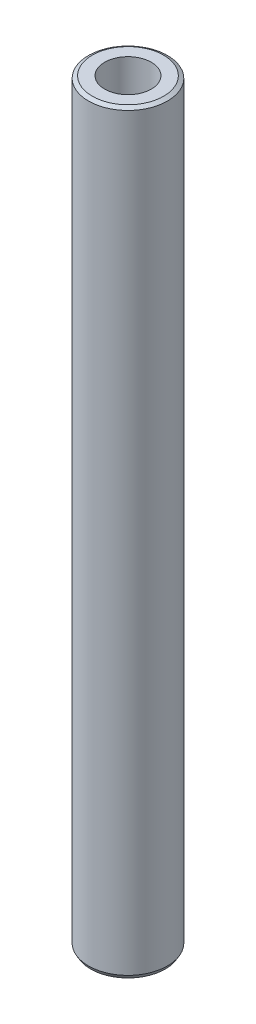
ISO-10303-21;
HEADER;
FILE_DESCRIPTION(('STEP AP214'),'2;1');
FILE_NAME('part.step','',(''),(''),'','','');
FILE_SCHEMA(('AUTOMOTIVE_DESIGN { 1 0 10303 214 1 1 1 1 }'));
ENDSEC;
DATA;
#1=APPLICATION_CONTEXT('core data for automotive mechanical design processes');
#2=APPLICATION_PROTOCOL_DEFINITION('international standard','automotive_design',2000,#1);
#3=PRODUCT_CONTEXT('',#1,'mechanical');
#4=PRODUCT('Part','Part','',(#3));
#5=PRODUCT_RELATED_PRODUCT_CATEGORY('part','',(#4));
#6=PRODUCT_DEFINITION_FORMATION('','',#4);
#7=PRODUCT_DEFINITION_CONTEXT('part definition',#1,'design');
#8=PRODUCT_DEFINITION('design','',#6,#7);
#9=PRODUCT_DEFINITION_SHAPE('','',#8);
#10=(LENGTH_UNIT() NAMED_UNIT(*) SI_UNIT(.MILLI.,.METRE.));
#11=(NAMED_UNIT(*) PLANE_ANGLE_UNIT() SI_UNIT($,.RADIAN.));
#12=(NAMED_UNIT(*) SI_UNIT($,.STERADIAN.) SOLID_ANGLE_UNIT());
#13=UNCERTAINTY_MEASURE_WITH_UNIT(LENGTH_MEASURE(1.E-05),#10,'distance_accuracy_value','');
#14=(GEOMETRIC_REPRESENTATION_CONTEXT(3) GLOBAL_UNCERTAINTY_ASSIGNED_CONTEXT((#13)) GLOBAL_UNIT_ASSIGNED_CONTEXT((#10,
#11,#12)) REPRESENTATION_CONTEXT('',''));
#15=CARTESIAN_POINT('',(0.,0.,0.));
#16=DIRECTION('',(0.,0.,1.));
#17=DIRECTION('',(1.,0.,0.));
#18=AXIS2_PLACEMENT_3D('',#15,#16,#17);
#19=CARTESIAN_POINT('',(0.,191.178711764376,0.));
#20=DIRECTION('',(0.,-1.,0.));
#21=DIRECTION('',(0.,0.,-1.));
#22=AXIS2_PLACEMENT_3D('',#19,#20,#21);
#23=CYLINDRICAL_SURFACE('',#22,10.);
#24=CARTESIAN_POINT('',(0.,190.615462888149,0.));
#25=DIRECTION('',(0.,1.,0.));
#26=DIRECTION('',(0.,0.,1.));
#27=AXIS2_PLACEMENT_3D('',#24,#25,#26);
#28=CIRCLE('',#27,10.);
#29=CARTESIAN_POINT('',(0.,190.615462888149,10.));
#30=VERTEX_POINT('',#29);
#31=EDGE_CURVE('E50',#30,#30,#28,.F.);
#32=ORIENTED_EDGE('',*,*,#31,.T.);
#33=EDGE_LOOP('',(#32));
#34=FACE_BOUND('',#33,.T.);
#35=CARTESIAN_POINT('',(0.,0.975575670930651,0.));
#36=DIRECTION('',(0.,1.,0.));
#37=DIRECTION('',(0.,0.,1.));
#38=AXIS2_PLACEMENT_3D('',#35,#36,#37);
#39=CIRCLE('',#38,10.);
#40=CARTESIAN_POINT('',(0.,0.975575670930651,10.));
#41=VERTEX_POINT('',#40);
#42=EDGE_CURVE('E51',#41,#41,#39,.T.);
#43=ORIENTED_EDGE('',*,*,#42,.T.);
#44=EDGE_LOOP('',(#43));
#45=FACE_BOUND('',#44,.T.);
#46=ADVANCED_FACE('F39',(#34,#45),#23,.T.);
#47=CARTESIAN_POINT('',(0.,191.178711764376,0.));
#48=DIRECTION('',(0.,1.,0.));
#49=DIRECTION('',(0.,0.,1.));
#50=AXIS2_PLACEMENT_3D('',#47,#48,#49);
#51=PLANE('',#50);
#52=CARTESIAN_POINT('',(0.,191.178711764376,0.));
#53=DIRECTION('',(0.,1.,0.));
#54=DIRECTION('',(0.,0.,1.));
#55=AXIS2_PLACEMENT_3D('',#52,#53,#54);
#56=CIRCLE('',#55,9.02442432906936);
#57=CARTESIAN_POINT('',(0.,191.178711764376,9.02442432906936));
#58=VERTEX_POINT('',#57);
#59=EDGE_CURVE('E54',#58,#58,#56,.T.);
#60=ORIENTED_EDGE('',*,*,#59,.T.);
#61=EDGE_LOOP('',(#60));
#62=FACE_BOUND('',#61,.T.);
#63=CARTESIAN_POINT('',(0.,191.178711764376,0.));
#64=DIRECTION('',(0.,1.,0.));
#65=DIRECTION('',(0.,0.,1.));
#66=AXIS2_PLACEMENT_3D('',#63,#64,#65);
#67=CIRCLE('',#66,5.90377454424036);
#68=CARTESIAN_POINT('',(0.,191.178711764376,5.90377454424036));
#69=VERTEX_POINT('',#68);
#70=EDGE_CURVE('E58',#69,#69,#67,.T.);
#71=ORIENTED_EDGE('',*,*,#70,.F.);
#72=EDGE_LOOP('',(#71));
#73=FACE_BOUND('',#72,.T.);
#74=ADVANCED_FACE('F69',(#62,#73),#51,.T.);
#75=CARTESIAN_POINT('',(0.,0.,0.));
#76=DIRECTION('',(0.,1.,0.));
#77=DIRECTION('',(0.,0.,1.));
#78=AXIS2_PLACEMENT_3D('',#75,#76,#77);
#79=PLANE('',#78);
#80=CARTESIAN_POINT('',(0.,0.,0.));
#81=DIRECTION('',(0.,1.,0.));
#82=DIRECTION('',(0.,0.,1.));
#83=AXIS2_PLACEMENT_3D('',#80,#81,#82);
#84=CIRCLE('',#83,9.43675112377333);
#85=CARTESIAN_POINT('',(0.,0.,9.43675112377333));
#86=VERTEX_POINT('',#85);
#87=EDGE_CURVE('E10',#86,#86,#84,.F.);
#88=ORIENTED_EDGE('',*,*,#87,.T.);
#89=EDGE_LOOP('',(#88));
#90=FACE_BOUND('',#89,.T.);
#91=CARTESIAN_POINT('',(0.,0.,0.));
#92=DIRECTION('',(0.,1.,0.));
#93=DIRECTION('',(0.,0.,1.));
#94=AXIS2_PLACEMENT_3D('',#91,#92,#93);
#95=CIRCLE('',#94,5.90377454424036);
#96=CARTESIAN_POINT('',(0.,0.,5.90377454424036));
#97=VERTEX_POINT('',#96);
#98=EDGE_CURVE('E63',#97,#97,#95,.T.);
#99=ORIENTED_EDGE('',*,*,#98,.T.);
#100=EDGE_LOOP('',(#99));
#101=FACE_BOUND('',#100,.T.);
#102=ADVANCED_FACE('F75',(#90,#101),#79,.F.);
#103=CARTESIAN_POINT('',(0.,191.178711764376,0.));
#104=DIRECTION('',(0.,-1.,0.));
#105=DIRECTION('',(0.,0.,-1.));
#106=AXIS2_PLACEMENT_3D('',#103,#104,#105);
#107=CYLINDRICAL_SURFACE('',#106,5.90377454424036);
#108=ORIENTED_EDGE('',*,*,#70,.T.);
#109=EDGE_LOOP('',(#108));
#110=FACE_BOUND('',#109,.T.);
#111=ORIENTED_EDGE('',*,*,#98,.F.);
#112=EDGE_LOOP('',(#111));
#113=FACE_BOUND('',#112,.T.);
#114=ADVANCED_FACE('F70',(#110,#113),#107,.F.);
#115=CARTESIAN_POINT('',(0.,191.178711764376,0.));
#116=DIRECTION('',(0.,-1.,0.));
#117=DIRECTION('',(0.,0.,-1.));
#118=AXIS2_PLACEMENT_3D('',#115,#116,#117);
#119=CONICAL_SURFACE('',#118,9.02442432906936,1.04719755119659);
#120=ORIENTED_EDGE('',*,*,#31,.F.);
#121=EDGE_LOOP('',(#120));
#122=FACE_BOUND('',#121,.T.);
#123=ORIENTED_EDGE('',*,*,#59,.F.);
#124=EDGE_LOOP('',(#123));
#125=FACE_BOUND('',#124,.T.);
#126=ADVANCED_FACE('F81',(#122,#125),#119,.T.);
#127=CARTESIAN_POINT('',(0.,0.975575670930651,0.));
#128=DIRECTION('',(0.,1.,0.));
#129=DIRECTION('',(0.,0.,1.));
#130=AXIS2_PLACEMENT_3D('',#127,#128,#129);
#131=CONICAL_SURFACE('',#130,10.,0.523598775598304);
#132=CARTESIAN_POINT('',(0.,0.,9.43675112377333));
#133=CARTESIAN_POINT('',(0.,0.0101622465721942,9.44261829956736));
#134=CARTESIAN_POINT('',(0.,0.0203244931443884,9.44848547536139));
#135=CARTESIAN_POINT('',(0.,0.040648986288777,9.46021982694944));
#136=CARTESIAN_POINT('',(0.,0.0508112328609713,9.46608700274347));
#137=CARTESIAN_POINT('',(0.,0.0711357260053598,9.47782135433153));
#138=CARTESIAN_POINT('',(0.,0.0812979725775541,9.48368853012555));
#139=CARTESIAN_POINT('',(0.,0.101622465721943,9.49542288171361));
#140=CARTESIAN_POINT('',(0.,0.111784712294137,9.50129005750764));
#141=CARTESIAN_POINT('',(0.,0.132109205438526,9.51302440909569));
#142=CARTESIAN_POINT('',(0.,0.14227145201072,9.51889158488972));
#143=CARTESIAN_POINT('',(0.,0.162595945155108,9.53062593647778));
#144=CARTESIAN_POINT('',(0.,0.172758191727303,9.5364931122718));
#145=CARTESIAN_POINT('',(0.,0.193082684871691,9.54822746385986));
#146=CARTESIAN_POINT('',(0.,0.203244931443885,9.55409463965389));
#147=CARTESIAN_POINT('',(0.,0.223569424588274,9.56582899124195));
#148=CARTESIAN_POINT('',(0.,0.233731671160468,9.57169616703597));
#149=CARTESIAN_POINT('',(0.,0.254056164304857,9.58343051862403));
#150=CARTESIAN_POINT('',(0.,0.264218410877051,9.58929769441805));
#151=CARTESIAN_POINT('',(0.,0.28454290402144,9.60103204600611));
#152=CARTESIAN_POINT('',(0.,0.294705150593634,9.60689922180014));
#153=CARTESIAN_POINT('',(0.,0.315029643738023,9.61863357338819));
#154=CARTESIAN_POINT('',(0.,0.325191890310217,9.62450074918222));
#155=CARTESIAN_POINT('',(0.,0.345516383454605,9.63623510077028));
#156=CARTESIAN_POINT('',(0.,0.3556786300268,9.6421022765643));
#157=CARTESIAN_POINT('',(0.,0.376003123171188,9.65383662815236));
#158=CARTESIAN_POINT('',(0.,0.386165369743382,9.65970380394639));
#159=CARTESIAN_POINT('',(0.,0.406489862887771,9.67143815553444));
#160=CARTESIAN_POINT('',(0.,0.416652109459965,9.67730533132847));
#161=CARTESIAN_POINT('',(0.,0.436976602604354,9.68903968291653));
#162=CARTESIAN_POINT('',(0.,0.447138849176548,9.69490685871055));
#163=CARTESIAN_POINT('',(0.,0.467463342320937,9.70664121029861));
#164=CARTESIAN_POINT('',(0.,0.477625588893131,9.71250838609264));
#165=CARTESIAN_POINT('',(0.,0.49795008203752,9.72424273768069));
#166=CARTESIAN_POINT('',(0.,0.508112328609714,9.73010991347472));
#167=CARTESIAN_POINT('',(0.,0.528436821754102,9.74184426506278));
#168=CARTESIAN_POINT('',(0.,0.538599068326297,9.74771144085681));
#169=CARTESIAN_POINT('',(0.,0.558923561470685,9.75944579244486));
#170=CARTESIAN_POINT('',(0.,0.56908580804288,9.76531296823889));
#171=CARTESIAN_POINT('',(0.,0.589410301187268,9.77704731982694));
#172=CARTESIAN_POINT('',(0.,0.599572547759462,9.78291449562097));
#173=CARTESIAN_POINT('',(0.,0.619897040903851,9.79464884720903));
#174=CARTESIAN_POINT('',(0.,0.630059287476045,9.80051602300306));
#175=CARTESIAN_POINT('',(0.,0.650383780620434,9.81225037459111));
#176=CARTESIAN_POINT('',(0.,0.660546027192628,9.81811755038514));
#177=CARTESIAN_POINT('',(0.,0.680870520337017,9.82985190197319));
#178=CARTESIAN_POINT('',(0.,0.691032766909211,9.83571907776722));
#179=CARTESIAN_POINT('',(0.,0.711357260053599,9.84745342935528));
#180=CARTESIAN_POINT('',(0.,0.721519506625794,9.8533206051493));
#181=CARTESIAN_POINT('',(0.,0.741843999770182,9.86505495673736));
#182=CARTESIAN_POINT('',(0.,0.752006246342376,9.87092213253139));
#183=CARTESIAN_POINT('',(0.,0.772330739486765,9.88265648411944));
#184=CARTESIAN_POINT('',(0.,0.782492986058959,9.88852365991347));
#185=CARTESIAN_POINT('',(0.,0.802817479203348,9.90025801150153));
#186=CARTESIAN_POINT('',(0.,0.812979725775542,9.90612518729556));
#187=CARTESIAN_POINT('',(0.,0.833304218919931,9.91785953888361));
#188=CARTESIAN_POINT('',(0.,0.843466465492125,9.92372671467764));
#189=CARTESIAN_POINT('',(0.,0.863790958636514,9.9354610662657));
#190=CARTESIAN_POINT('',(0.,0.873953205208708,9.94132824205972));
#191=CARTESIAN_POINT('',(0.,0.894277698353096,9.95306259364778));
#192=CARTESIAN_POINT('',(0.,0.904439944925291,9.95892976944181));
#193=CARTESIAN_POINT('',(0.,0.924764438069679,9.97066412102986));
#194=CARTESIAN_POINT('',(0.,0.934926684641873,9.97653129682389));
#195=CARTESIAN_POINT('',(0.,0.955251177786262,9.98826564841194));
#196=CARTESIAN_POINT('',(0.,0.965413424358456,9.99413282420597));
#197=CARTESIAN_POINT('',(0.,0.975575670930651,10.));
#198=B_SPLINE_CURVE_WITH_KNOTS('',3,(#132,#133,#134,#135,#136,#137,#138,#139,#140,#141,#142,
#143,#144,#145,#146,#147,#148,#149,#150,#151,#152,#153,#154,#155,#156,#157,#158,#159,#160,#161,
#162,#163,#164,#165,#166,#167,#168,#169,#170,#171,#172,#173,#174,#175,#176,#177,#178,#179,#180,
#181,#182,#183,#184,#185,#186,#187,#188,#189,#190,#191,#192,#193,#194,#195,#196,#197),
.UNSPECIFIED.,.F.,.F.,(4,2,2,2,2,2,2,2,2,2,2,2,2,2,2,2,2,2,2,2,2,2,2,2,2,2,2,2,2,2,2,2,4),(0.,
0.0352030547641663,0.0704061095283327,0.105609164292499,0.140812219056665,0.176015273820832,
0.211218328584998,0.246421383349165,0.281624438113332,0.316827492877498,0.352030547641664,
0.387233602405831,0.422436657169997,0.457639711934163,0.49284276669833,0.528045821462496,
0.563248876226662,0.598451930990829,0.633654985754996,0.668858040519162,0.704061095283328,
0.739264150047495,0.774467204811661,0.809670259575828,0.844873314339994,0.88007636910416,
0.915279423868326,0.950482478632494,0.98568553339666,1.02088858816083,1.05609164292499,
1.09129469768916,1.12649775245333),.UNSPECIFIED.);
#199=EDGE_CURVE('BSEAM45',#86,#41,#198,.T.);
#200=ORIENTED_EDGE('',*,*,#87,.F.);
#201=ORIENTED_EDGE('',*,*,#42,.F.);
#202=ORIENTED_EDGE('',*,*,#199,.T.);
#203=ORIENTED_EDGE('',*,*,#199,.F.);
#204=EDGE_LOOP('',(#200,#202,#201,#203));
#205=FACE_BOUND('',#204,.T.);
#206=ADVANCED_FACE('F45',(#205),#131,.T.);
#207=CLOSED_SHELL('',(#46,#74,#102,#114,#126,#206));
#208=MANIFOLD_SOLID_BREP('B2',#207);
#209=ADVANCED_BREP_SHAPE_REPRESENTATION('',(#18,#208),#14);
#210=SHAPE_DEFINITION_REPRESENTATION(#9,#209);
ENDSEC;
END-ISO-10303-21;
